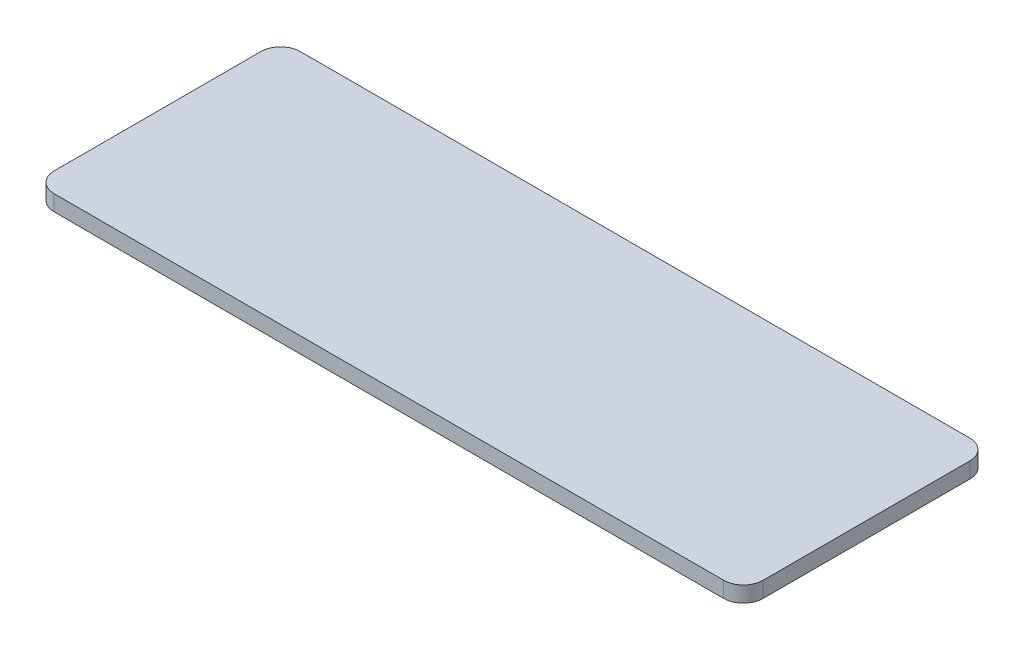
ISO-10303-21;
HEADER;
FILE_DESCRIPTION(('STEP AP214'),'2;1');
FILE_NAME('part.step','',(''),(''),'','','');
FILE_SCHEMA(('AUTOMOTIVE_DESIGN { 1 0 10303 214 1 1 1 1 }'));
ENDSEC;
DATA;
#1=APPLICATION_CONTEXT('core data for automotive mechanical design processes');
#2=APPLICATION_PROTOCOL_DEFINITION('international standard','automotive_design',2000,#1);
#3=PRODUCT_CONTEXT('',#1,'mechanical');
#4=PRODUCT('Part','Part','',(#3));
#5=PRODUCT_RELATED_PRODUCT_CATEGORY('part','',(#4));
#6=PRODUCT_DEFINITION_FORMATION('','',#4);
#7=PRODUCT_DEFINITION_CONTEXT('part definition',#1,'design');
#8=PRODUCT_DEFINITION('design','',#6,#7);
#9=PRODUCT_DEFINITION_SHAPE('','',#8);
#10=(LENGTH_UNIT() NAMED_UNIT(*) SI_UNIT(.MILLI.,.METRE.));
#11=(NAMED_UNIT(*) PLANE_ANGLE_UNIT() SI_UNIT($,.RADIAN.));
#12=(NAMED_UNIT(*) SI_UNIT($,.STERADIAN.) SOLID_ANGLE_UNIT());
#13=UNCERTAINTY_MEASURE_WITH_UNIT(LENGTH_MEASURE(1.E-05),#10,'distance_accuracy_value','');
#14=(GEOMETRIC_REPRESENTATION_CONTEXT(3) GLOBAL_UNCERTAINTY_ASSIGNED_CONTEXT((#13)) GLOBAL_UNIT_ASSIGNED_CONTEXT((#10,
#11,#12)) REPRESENTATION_CONTEXT('',''));
#15=CARTESIAN_POINT('',(0.,0.,0.));
#16=DIRECTION('',(0.,0.,1.));
#17=DIRECTION('',(1.,0.,0.));
#18=AXIS2_PLACEMENT_3D('',#15,#16,#17);
#19=CARTESIAN_POINT('',(0.,1.6,0.));
#20=DIRECTION('',(1.,0.,0.));
#21=DIRECTION('',(0.,0.,-1.));
#22=AXIS2_PLACEMENT_3D('',#19,#20,#21);
#23=PLANE('',#22);
#24=DIRECTION('',(0.,0.,1.));
#25=VECTOR('',#24,1.);
#26=CARTESIAN_POINT('',(0.,0.,0.));
#27=LINE('',#26,#25);
#28=CARTESIAN_POINT('',(0.,0.,-23.));
#29=VERTEX_POINT('',#28);
#30=CARTESIAN_POINT('',(0.,0.,-2.));
#31=VERTEX_POINT('',#30);
#32=EDGE_CURVE('E126',#29,#31,#27,.T.);
#33=ORIENTED_EDGE('',*,*,#32,.T.);
#34=DIRECTION('',(0.,-1.,0.));
#35=VECTOR('',#34,1.);
#36=CARTESIAN_POINT('',(0.,1.6,-2.));
#37=LINE('',#36,#35);
#38=CARTESIAN_POINT('',(0.,1.6,-2.));
#39=VERTEX_POINT('',#38);
#40=EDGE_CURVE('E104',#31,#39,#37,.F.);
#41=ORIENTED_EDGE('',*,*,#40,.T.);
#42=DIRECTION('',(0.,0.,1.));
#43=VECTOR('',#42,1.);
#44=CARTESIAN_POINT('',(0.,1.6,0.));
#45=LINE('',#44,#43);
#46=CARTESIAN_POINT('',(0.,1.6,-23.));
#47=VERTEX_POINT('',#46);
#48=EDGE_CURVE('E135',#47,#39,#45,.T.);
#49=ORIENTED_EDGE('',*,*,#48,.F.);
#50=DIRECTION('',(0.,-1.,0.));
#51=VECTOR('',#50,1.);
#52=CARTESIAN_POINT('',(0.,1.6,-23.));
#53=LINE('',#52,#51);
#54=EDGE_CURVE('E109',#47,#29,#53,.T.);
#55=ORIENTED_EDGE('',*,*,#54,.T.);
#56=EDGE_LOOP('',(#33,#41,#49,#55));
#57=FACE_BOUND('',#56,.T.);
#58=ADVANCED_FACE('F33',(#57),#23,.F.);
#59=CARTESIAN_POINT('',(0.,1.6,0.));
#60=DIRECTION('',(0.,0.,-1.));
#61=DIRECTION('',(-1.,0.,0.));
#62=AXIS2_PLACEMENT_3D('',#59,#60,#61);
#63=PLANE('',#62);
#64=DIRECTION('',(1.,0.,0.));
#65=VECTOR('',#64,1.);
#66=CARTESIAN_POINT('',(0.,1.6,0.));
#67=LINE('',#66,#65);
#68=CARTESIAN_POINT('',(2.,1.6,0.));
#69=VERTEX_POINT('',#68);
#70=CARTESIAN_POINT('',(70.,1.6,0.));
#71=VERTEX_POINT('',#70);
#72=EDGE_CURVE('E119',#69,#71,#67,.T.);
#73=ORIENTED_EDGE('',*,*,#72,.F.);
#74=DIRECTION('',(0.,-1.,0.));
#75=VECTOR('',#74,1.);
#76=CARTESIAN_POINT('',(2.,1.6,0.));
#77=LINE('',#76,#75);
#78=CARTESIAN_POINT('',(2.,0.,0.));
#79=VERTEX_POINT('',#78);
#80=EDGE_CURVE('E103',#69,#79,#77,.T.);
#81=ORIENTED_EDGE('',*,*,#80,.T.);
#82=DIRECTION('',(1.,0.,0.));
#83=VECTOR('',#82,1.);
#84=CARTESIAN_POINT('',(0.,0.,0.));
#85=LINE('',#84,#83);
#86=CARTESIAN_POINT('',(70.,0.,0.));
#87=VERTEX_POINT('',#86);
#88=EDGE_CURVE('E116',#79,#87,#85,.T.);
#89=ORIENTED_EDGE('',*,*,#88,.T.);
#90=DIRECTION('',(0.,-1.,0.));
#91=VECTOR('',#90,1.);
#92=CARTESIAN_POINT('',(70.,1.6,0.));
#93=LINE('',#92,#91);
#94=EDGE_CURVE('E121',#87,#71,#93,.F.);
#95=ORIENTED_EDGE('',*,*,#94,.T.);
#96=EDGE_LOOP('',(#73,#81,#89,#95));
#97=FACE_BOUND('',#96,.T.);
#98=ADVANCED_FACE('F115',(#97),#63,.F.);
#99=CARTESIAN_POINT('',(72.,1.6,0.));
#100=DIRECTION('',(-1.,0.,0.));
#101=DIRECTION('',(0.,0.,1.));
#102=AXIS2_PLACEMENT_3D('',#99,#100,#101);
#103=PLANE('',#102);
#104=DIRECTION('',(0.,0.,-1.));
#105=VECTOR('',#104,1.);
#106=CARTESIAN_POINT('',(72.,0.,0.));
#107=LINE('',#106,#105);
#108=CARTESIAN_POINT('',(72.,0.,-2.));
#109=VERTEX_POINT('',#108);
#110=CARTESIAN_POINT('',(72.,0.,-23.));
#111=VERTEX_POINT('',#110);
#112=EDGE_CURVE('E125',#109,#111,#107,.T.);
#113=ORIENTED_EDGE('',*,*,#112,.T.);
#114=DIRECTION('',(0.,-1.,0.));
#115=VECTOR('',#114,1.);
#116=CARTESIAN_POINT('',(72.,1.6,-23.));
#117=LINE('',#116,#115);
#118=CARTESIAN_POINT('',(72.,1.6,-23.));
#119=VERTEX_POINT('',#118);
#120=EDGE_CURVE('E11',#111,#119,#117,.F.);
#121=ORIENTED_EDGE('',*,*,#120,.T.);
#122=DIRECTION('',(0.,0.,-1.));
#123=VECTOR('',#122,1.);
#124=CARTESIAN_POINT('',(72.,1.6,0.));
#125=LINE('',#124,#123);
#126=CARTESIAN_POINT('',(72.,1.6,-2.));
#127=VERTEX_POINT('',#126);
#128=EDGE_CURVE('E161',#127,#119,#125,.T.);
#129=ORIENTED_EDGE('',*,*,#128,.F.);
#130=DIRECTION('',(0.,-1.,0.));
#131=VECTOR('',#130,1.);
#132=CARTESIAN_POINT('',(72.,1.6,-2.));
#133=LINE('',#132,#131);
#134=EDGE_CURVE('E41',#127,#109,#133,.T.);
#135=ORIENTED_EDGE('',*,*,#134,.T.);
#136=EDGE_LOOP('',(#113,#121,#129,#135));
#137=FACE_BOUND('',#136,.T.);
#138=ADVANCED_FACE('F159',(#137),#103,.F.);
#139=CARTESIAN_POINT('',(0.,1.6,-25.));
#140=DIRECTION('',(0.,0.,1.));
#141=DIRECTION('',(1.,0.,0.));
#142=AXIS2_PLACEMENT_3D('',#139,#140,#141);
#143=PLANE('',#142);
#144=DIRECTION('',(-1.,0.,0.));
#145=VECTOR('',#144,1.);
#146=CARTESIAN_POINT('',(0.,0.,-25.));
#147=LINE('',#146,#145);
#148=CARTESIAN_POINT('',(70.,0.,-25.));
#149=VERTEX_POINT('',#148);
#150=CARTESIAN_POINT('',(2.,0.,-25.));
#151=VERTEX_POINT('',#150);
#152=EDGE_CURVE('E129',#149,#151,#147,.T.);
#153=ORIENTED_EDGE('',*,*,#152,.T.);
#154=DIRECTION('',(0.,-1.,0.));
#155=VECTOR('',#154,1.);
#156=CARTESIAN_POINT('',(2.,1.6,-25.));
#157=LINE('',#156,#155);
#158=CARTESIAN_POINT('',(2.,1.6,-25.));
#159=VERTEX_POINT('',#158);
#160=EDGE_CURVE('E48',#151,#159,#157,.F.);
#161=ORIENTED_EDGE('',*,*,#160,.T.);
#162=DIRECTION('',(-1.,0.,0.));
#163=VECTOR('',#162,1.);
#164=CARTESIAN_POINT('',(0.,1.6,-25.));
#165=LINE('',#164,#163);
#166=CARTESIAN_POINT('',(70.,1.6,-25.));
#167=VERTEX_POINT('',#166);
#168=EDGE_CURVE('E136',#167,#159,#165,.T.);
#169=ORIENTED_EDGE('',*,*,#168,.F.);
#170=DIRECTION('',(0.,-1.,0.));
#171=VECTOR('',#170,1.);
#172=CARTESIAN_POINT('',(70.,1.6,-25.));
#173=LINE('',#172,#171);
#174=EDGE_CURVE('E152',#167,#149,#173,.T.);
#175=ORIENTED_EDGE('',*,*,#174,.T.);
#176=EDGE_LOOP('',(#153,#161,#169,#175));
#177=FACE_BOUND('',#176,.T.);
#178=ADVANCED_FACE('F168',(#177),#143,.F.);
#179=CARTESIAN_POINT('',(0.,1.6,0.));
#180=DIRECTION('',(0.,-1.,0.));
#181=DIRECTION('',(0.,0.,-1.));
#182=AXIS2_PLACEMENT_3D('',#179,#180,#181);
#183=PLANE('',#182);
#184=ORIENTED_EDGE('',*,*,#48,.T.);
#185=CARTESIAN_POINT('',(2.,1.6,-2.));
#186=DIRECTION('',(0.,-1.,0.));
#187=DIRECTION('',(0.,0.,-1.));
#188=AXIS2_PLACEMENT_3D('',#185,#186,#187);
#189=CIRCLE('',#188,2.);
#190=EDGE_CURVE('E150',#39,#69,#189,.F.);
#191=ORIENTED_EDGE('',*,*,#190,.T.);
#192=ORIENTED_EDGE('',*,*,#72,.T.);
#193=CARTESIAN_POINT('',(70.,1.6,-2.));
#194=DIRECTION('',(0.,-1.,0.));
#195=DIRECTION('',(0.,0.,-1.));
#196=AXIS2_PLACEMENT_3D('',#193,#194,#195);
#197=CIRCLE('',#196,2.);
#198=EDGE_CURVE('E145',#71,#127,#197,.F.);
#199=ORIENTED_EDGE('',*,*,#198,.T.);
#200=ORIENTED_EDGE('',*,*,#128,.T.);
#201=CARTESIAN_POINT('',(70.,1.6,-23.));
#202=DIRECTION('',(0.,-1.,0.));
#203=DIRECTION('',(0.,0.,-1.));
#204=AXIS2_PLACEMENT_3D('',#201,#202,#203);
#205=CIRCLE('',#204,2.);
#206=EDGE_CURVE('E55',#119,#167,#205,.F.);
#207=ORIENTED_EDGE('',*,*,#206,.T.);
#208=ORIENTED_EDGE('',*,*,#168,.T.);
#209=CARTESIAN_POINT('',(2.,1.6,-23.));
#210=DIRECTION('',(0.,-1.,0.));
#211=DIRECTION('',(0.,0.,-1.));
#212=AXIS2_PLACEMENT_3D('',#209,#210,#211);
#213=CIRCLE('',#212,2.);
#214=EDGE_CURVE('E148',#159,#47,#213,.F.);
#215=ORIENTED_EDGE('',*,*,#214,.T.);
#216=EDGE_LOOP('',(#184,#191,#192,#199,#200,#207,#208,#215));
#217=FACE_BOUND('',#216,.T.);
#218=ADVANCED_FACE('F175',(#217),#183,.F.);
#219=CARTESIAN_POINT('',(0.,0.,0.));
#220=DIRECTION('',(0.,-1.,0.));
#221=DIRECTION('',(0.,0.,-1.));
#222=AXIS2_PLACEMENT_3D('',#219,#220,#221);
#223=PLANE('',#222);
#224=ORIENTED_EDGE('',*,*,#88,.F.);
#225=CARTESIAN_POINT('',(2.,0.,-2.));
#226=DIRECTION('',(0.,-1.,0.));
#227=DIRECTION('',(0.,0.,-1.));
#228=AXIS2_PLACEMENT_3D('',#225,#226,#227);
#229=CIRCLE('',#228,2.);
#230=EDGE_CURVE('E99',#79,#31,#229,.T.);
#231=ORIENTED_EDGE('',*,*,#230,.T.);
#232=ORIENTED_EDGE('',*,*,#32,.F.);
#233=CARTESIAN_POINT('',(2.,0.,-23.));
#234=DIRECTION('',(0.,-1.,0.));
#235=DIRECTION('',(0.,0.,-1.));
#236=AXIS2_PLACEMENT_3D('',#233,#234,#235);
#237=CIRCLE('',#236,2.);
#238=EDGE_CURVE('E110',#29,#151,#237,.T.);
#239=ORIENTED_EDGE('',*,*,#238,.T.);
#240=ORIENTED_EDGE('',*,*,#152,.F.);
#241=CARTESIAN_POINT('',(70.,0.,-23.));
#242=DIRECTION('',(0.,-1.,0.));
#243=DIRECTION('',(0.,0.,-1.));
#244=AXIS2_PLACEMENT_3D('',#241,#242,#243);
#245=CIRCLE('',#244,2.);
#246=EDGE_CURVE('E139',#149,#111,#245,.T.);
#247=ORIENTED_EDGE('',*,*,#246,.T.);
#248=ORIENTED_EDGE('',*,*,#112,.F.);
#249=CARTESIAN_POINT('',(70.,0.,-2.));
#250=DIRECTION('',(0.,-1.,0.));
#251=DIRECTION('',(0.,0.,-1.));
#252=AXIS2_PLACEMENT_3D('',#249,#250,#251);
#253=CIRCLE('',#252,2.);
#254=EDGE_CURVE('E120',#109,#87,#253,.T.);
#255=ORIENTED_EDGE('',*,*,#254,.T.);
#256=EDGE_LOOP('',(#224,#231,#232,#239,#240,#247,#248,#255));
#257=FACE_BOUND('',#256,.T.);
#258=ADVANCED_FACE('F123',(#257),#223,.T.);
#259=CARTESIAN_POINT('',(2.,1.6,-2.));
#260=DIRECTION('',(0.,-1.,0.));
#261=DIRECTION('',(0.,0.,-1.));
#262=AXIS2_PLACEMENT_3D('',#259,#260,#261);
#263=CYLINDRICAL_SURFACE('',#262,2.);
#264=ORIENTED_EDGE('',*,*,#190,.F.);
#265=ORIENTED_EDGE('',*,*,#40,.F.);
#266=ORIENTED_EDGE('',*,*,#230,.F.);
#267=ORIENTED_EDGE('',*,*,#80,.F.);
#268=EDGE_LOOP('',(#264,#265,#266,#267));
#269=FACE_BOUND('',#268,.T.);
#270=ADVANCED_FACE('F102',(#269),#263,.T.);
#271=CARTESIAN_POINT('',(2.,1.6,-23.));
#272=DIRECTION('',(0.,-1.,0.));
#273=DIRECTION('',(0.,0.,-1.));
#274=AXIS2_PLACEMENT_3D('',#271,#272,#273);
#275=CYLINDRICAL_SURFACE('',#274,2.);
#276=ORIENTED_EDGE('',*,*,#214,.F.);
#277=ORIENTED_EDGE('',*,*,#160,.F.);
#278=ORIENTED_EDGE('',*,*,#238,.F.);
#279=ORIENTED_EDGE('',*,*,#54,.F.);
#280=EDGE_LOOP('',(#276,#277,#278,#279));
#281=FACE_BOUND('',#280,.T.);
#282=ADVANCED_FACE('F179',(#281),#275,.T.);
#283=CARTESIAN_POINT('',(70.,1.6,-23.));
#284=DIRECTION('',(0.,-1.,0.));
#285=DIRECTION('',(0.,0.,-1.));
#286=AXIS2_PLACEMENT_3D('',#283,#284,#285);
#287=CYLINDRICAL_SURFACE('',#286,2.);
#288=ORIENTED_EDGE('',*,*,#206,.F.);
#289=ORIENTED_EDGE('',*,*,#120,.F.);
#290=ORIENTED_EDGE('',*,*,#246,.F.);
#291=ORIENTED_EDGE('',*,*,#174,.F.);
#292=EDGE_LOOP('',(#288,#289,#290,#291));
#293=FACE_BOUND('',#292,.T.);
#294=ADVANCED_FACE('F167',(#293),#287,.T.);
#295=CARTESIAN_POINT('',(70.,1.6,-2.));
#296=DIRECTION('',(0.,-1.,0.));
#297=DIRECTION('',(0.,0.,-1.));
#298=AXIS2_PLACEMENT_3D('',#295,#296,#297);
#299=CYLINDRICAL_SURFACE('',#298,2.);
#300=ORIENTED_EDGE('',*,*,#198,.F.);
#301=ORIENTED_EDGE('',*,*,#94,.F.);
#302=ORIENTED_EDGE('',*,*,#254,.F.);
#303=ORIENTED_EDGE('',*,*,#134,.F.);
#304=EDGE_LOOP('',(#300,#301,#302,#303));
#305=FACE_BOUND('',#304,.T.);
#306=ADVANCED_FACE('F35',(#305),#299,.T.);
#307=CLOSED_SHELL('',(#58,#98,#138,#178,#218,#258,#270,#282,#294,#306));
#308=MANIFOLD_SOLID_BREP('B2',#307);
#309=ADVANCED_BREP_SHAPE_REPRESENTATION('',(#18,#308),#14);
#310=SHAPE_DEFINITION_REPRESENTATION(#9,#309);
ENDSEC;
END-ISO-10303-21;
